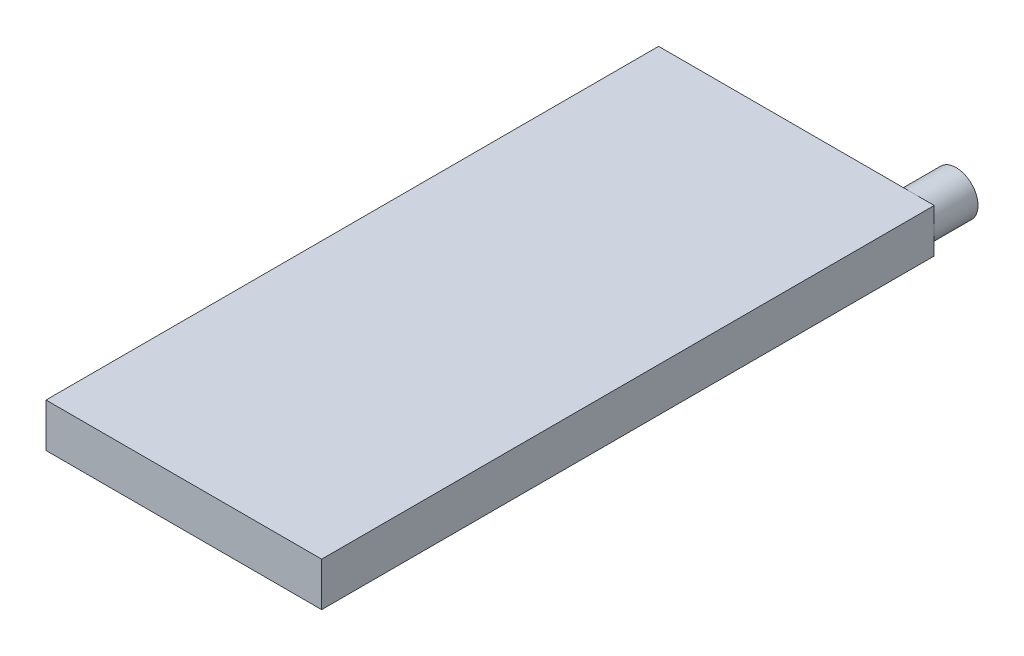
ISO-10303-21;
HEADER;
FILE_DESCRIPTION(('STEP AP214'),'2;1');
FILE_NAME('part.step','',(''),(''),'','','');
FILE_SCHEMA(('AUTOMOTIVE_DESIGN { 1 0 10303 214 1 1 1 1 }'));
ENDSEC;
DATA;
#1=APPLICATION_CONTEXT('core data for automotive mechanical design processes');
#2=APPLICATION_PROTOCOL_DEFINITION('international standard','automotive_design',2000,#1);
#3=PRODUCT_CONTEXT('',#1,'mechanical');
#4=PRODUCT('Part','Part','',(#3));
#5=PRODUCT_RELATED_PRODUCT_CATEGORY('part','',(#4));
#6=PRODUCT_DEFINITION_FORMATION('','',#4);
#7=PRODUCT_DEFINITION_CONTEXT('part definition',#1,'design');
#8=PRODUCT_DEFINITION('design','',#6,#7);
#9=PRODUCT_DEFINITION_SHAPE('','',#8);
#10=(LENGTH_UNIT() NAMED_UNIT(*) SI_UNIT(.MILLI.,.METRE.));
#11=(NAMED_UNIT(*) PLANE_ANGLE_UNIT() SI_UNIT($,.RADIAN.));
#12=(NAMED_UNIT(*) SI_UNIT($,.STERADIAN.) SOLID_ANGLE_UNIT());
#13=UNCERTAINTY_MEASURE_WITH_UNIT(LENGTH_MEASURE(1.E-05),#10,'distance_accuracy_value','');
#14=(GEOMETRIC_REPRESENTATION_CONTEXT(3) GLOBAL_UNCERTAINTY_ASSIGNED_CONTEXT((#13)) GLOBAL_UNIT_ASSIGNED_CONTEXT((#10,
#11,#12)) REPRESENTATION_CONTEXT('',''));
#15=CARTESIAN_POINT('',(0.,0.,0.));
#16=DIRECTION('',(0.,0.,1.));
#17=DIRECTION('',(1.,0.,0.));
#18=AXIS2_PLACEMENT_3D('',#15,#16,#17);
#19=CARTESIAN_POINT('',(0.,10.,-140.));
#20=DIRECTION('',(0.,0.,1.));
#21=DIRECTION('',(1.,0.,0.));
#22=AXIS2_PLACEMENT_3D('',#19,#20,#21);
#23=PLANE('',#22);
#24=CARTESIAN_POINT('',(-5.,5.,-140.));
#25=DIRECTION('',(0.,0.,-1.));
#26=DIRECTION('',(-1.,0.,0.));
#27=AXIS2_PLACEMENT_3D('',#24,#25,#26);
#28=CIRCLE('',#27,5.);
#29=CARTESIAN_POINT('',(-5.,10.,-140.));
#30=VERTEX_POINT('',#29);
#31=CARTESIAN_POINT('',(0.,5.,-140.));
#32=VERTEX_POINT('',#31);
#33=EDGE_CURVE('E44',#30,#32,#28,.T.);
#34=ORIENTED_EDGE('',*,*,#33,.F.);
#35=DIRECTION('',(-1.,0.,0.));
#36=VECTOR('',#35,1.);
#37=CARTESIAN_POINT('',(0.,10.,-140.));
#38=LINE('',#37,#36);
#39=CARTESIAN_POINT('',(0.,10.,-140.));
#40=VERTEX_POINT('',#39);
#41=EDGE_CURVE('E84',#40,#30,#38,.T.);
#42=ORIENTED_EDGE('',*,*,#41,.F.);
#43=DIRECTION('',(0.,-1.,0.));
#44=VECTOR('',#43,1.);
#45=CARTESIAN_POINT('',(0.,10.,-140.));
#46=LINE('',#45,#44);
#47=EDGE_CURVE('E37',#40,#32,#46,.T.);
#48=ORIENTED_EDGE('',*,*,#47,.T.);
#49=EDGE_LOOP('',(#34,#42,#48));
#50=FACE_BOUND('',#49,.T.);
#51=ADVANCED_FACE('F33',(#50),#23,.F.);
#52=CARTESIAN_POINT('',(-5.,0.,-140.));
#53=VERTEX_POINT('',#52);
#54=EDGE_CURVE('E11',#32,#53,#28,.T.);
#55=ORIENTED_EDGE('',*,*,#54,.F.);
#56=CARTESIAN_POINT('',(0.,0.,-140.));
#57=VERTEX_POINT('',#56);
#58=EDGE_CURVE('E104',#32,#57,#46,.T.);
#59=ORIENTED_EDGE('',*,*,#58,.T.);
#60=DIRECTION('',(-1.,0.,0.));
#61=VECTOR('',#60,1.);
#62=CARTESIAN_POINT('',(0.,0.,-140.));
#63=LINE('',#62,#61);
#64=EDGE_CURVE('E117',#57,#53,#63,.T.);
#65=ORIENTED_EDGE('',*,*,#64,.T.);
#66=EDGE_LOOP('',(#55,#59,#65));
#67=FACE_BOUND('',#66,.T.);
#68=ADVANCED_FACE('F129',(#67),#23,.F.);
#69=CARTESIAN_POINT('',(0.,10.,0.));
#70=DIRECTION('',(-1.,0.,0.));
#71=DIRECTION('',(0.,0.,1.));
#72=AXIS2_PLACEMENT_3D('',#69,#70,#71);
#73=PLANE('',#72);
#74=DIRECTION('',(0.,0.,-1.));
#75=VECTOR('',#74,1.);
#76=CARTESIAN_POINT('',(0.,0.,0.));
#77=LINE('',#76,#75);
#78=CARTESIAN_POINT('',(0.,0.,0.));
#79=VERTEX_POINT('',#78);
#80=EDGE_CURVE('E113',#79,#57,#77,.T.);
#81=ORIENTED_EDGE('',*,*,#80,.T.);
#82=ORIENTED_EDGE('',*,*,#58,.F.);
#83=ORIENTED_EDGE('',*,*,#47,.F.);
#84=DIRECTION('',(0.,0.,-1.));
#85=VECTOR('',#84,1.);
#86=CARTESIAN_POINT('',(0.,10.,0.));
#87=LINE('',#86,#85);
#88=CARTESIAN_POINT('',(0.,10.,0.));
#89=VERTEX_POINT('',#88);
#90=EDGE_CURVE('E89',#89,#40,#87,.T.);
#91=ORIENTED_EDGE('',*,*,#90,.F.);
#92=DIRECTION('',(0.,-1.,0.));
#93=VECTOR('',#92,1.);
#94=CARTESIAN_POINT('',(0.,10.,0.));
#95=LINE('',#94,#93);
#96=EDGE_CURVE('E112',#89,#79,#95,.T.);
#97=ORIENTED_EDGE('',*,*,#96,.T.);
#98=EDGE_LOOP('',(#81,#82,#83,#91,#97));
#99=FACE_BOUND('',#98,.T.);
#100=ADVANCED_FACE('F35',(#99),#73,.F.);
#101=EDGE_CURVE('E42',#53,#30,#28,.T.);
#102=ORIENTED_EDGE('',*,*,#101,.F.);
#103=CARTESIAN_POINT('',(-63.,0.,-140.));
#104=VERTEX_POINT('',#103);
#105=EDGE_CURVE('E116',#53,#104,#63,.T.);
#106=ORIENTED_EDGE('',*,*,#105,.T.);
#107=DIRECTION('',(0.,-1.,0.));
#108=VECTOR('',#107,1.);
#109=CARTESIAN_POINT('',(-63.,10.,-140.));
#110=LINE('',#109,#108);
#111=CARTESIAN_POINT('',(-63.,10.,-140.));
#112=VERTEX_POINT('',#111);
#113=EDGE_CURVE('E98',#112,#104,#110,.T.);
#114=ORIENTED_EDGE('',*,*,#113,.F.);
#115=EDGE_CURVE('E86',#30,#112,#38,.T.);
#116=ORIENTED_EDGE('',*,*,#115,.F.);
#117=EDGE_LOOP('',(#102,#106,#114,#116));
#118=FACE_BOUND('',#117,.T.);
#119=ADVANCED_FACE('F96',(#118),#23,.F.);
#120=CARTESIAN_POINT('',(-63.,10.,0.));
#121=DIRECTION('',(1.,0.,0.));
#122=DIRECTION('',(0.,0.,-1.));
#123=AXIS2_PLACEMENT_3D('',#120,#121,#122);
#124=PLANE('',#123);
#125=DIRECTION('',(0.,0.,1.));
#126=VECTOR('',#125,1.);
#127=CARTESIAN_POINT('',(-63.,0.,0.));
#128=LINE('',#127,#126);
#129=CARTESIAN_POINT('',(-63.,0.,0.));
#130=VERTEX_POINT('',#129);
#131=EDGE_CURVE('E119',#104,#130,#128,.T.);
#132=ORIENTED_EDGE('',*,*,#131,.T.);
#133=DIRECTION('',(0.,-1.,0.));
#134=VECTOR('',#133,1.);
#135=CARTESIAN_POINT('',(-63.,10.,0.));
#136=LINE('',#135,#134);
#137=CARTESIAN_POINT('',(-63.,10.,0.));
#138=VERTEX_POINT('',#137);
#139=EDGE_CURVE('E124',#138,#130,#136,.T.);
#140=ORIENTED_EDGE('',*,*,#139,.F.);
#141=DIRECTION('',(0.,0.,1.));
#142=VECTOR('',#141,1.);
#143=CARTESIAN_POINT('',(-63.,10.,0.));
#144=LINE('',#143,#142);
#145=EDGE_CURVE('E94',#112,#138,#144,.T.);
#146=ORIENTED_EDGE('',*,*,#145,.F.);
#147=ORIENTED_EDGE('',*,*,#113,.T.);
#148=EDGE_LOOP('',(#132,#140,#146,#147));
#149=FACE_BOUND('',#148,.T.);
#150=ADVANCED_FACE('F140',(#149),#124,.F.);
#151=CARTESIAN_POINT('',(0.,10.,0.));
#152=DIRECTION('',(0.,0.,-1.));
#153=DIRECTION('',(-1.,0.,0.));
#154=AXIS2_PLACEMENT_3D('',#151,#152,#153);
#155=PLANE('',#154);
#156=DIRECTION('',(1.,0.,0.));
#157=VECTOR('',#156,1.);
#158=CARTESIAN_POINT('',(0.,0.,0.));
#159=LINE('',#158,#157);
#160=EDGE_CURVE('E107',#130,#79,#159,.T.);
#161=ORIENTED_EDGE('',*,*,#160,.T.);
#162=ORIENTED_EDGE('',*,*,#96,.F.);
#163=DIRECTION('',(1.,0.,0.));
#164=VECTOR('',#163,1.);
#165=CARTESIAN_POINT('',(0.,10.,0.));
#166=LINE('',#165,#164);
#167=EDGE_CURVE('E110',#138,#89,#166,.T.);
#168=ORIENTED_EDGE('',*,*,#167,.F.);
#169=ORIENTED_EDGE('',*,*,#139,.T.);
#170=EDGE_LOOP('',(#161,#162,#168,#169));
#171=FACE_BOUND('',#170,.T.);
#172=ADVANCED_FACE('F138',(#171),#155,.F.);
#173=CARTESIAN_POINT('',(0.,10.,0.));
#174=DIRECTION('',(0.,1.,0.));
#175=DIRECTION('',(0.,0.,1.));
#176=AXIS2_PLACEMENT_3D('',#173,#174,#175);
#177=PLANE('',#176);
#178=ORIENTED_EDGE('',*,*,#90,.T.);
#179=ORIENTED_EDGE('',*,*,#41,.T.);
#180=ORIENTED_EDGE('',*,*,#115,.T.);
#181=ORIENTED_EDGE('',*,*,#145,.T.);
#182=ORIENTED_EDGE('',*,*,#167,.T.);
#183=EDGE_LOOP('',(#178,#179,#180,#181,#182));
#184=FACE_BOUND('',#183,.T.);
#185=ADVANCED_FACE('F85',(#184),#177,.T.);
#186=CARTESIAN_POINT('',(0.,0.,0.));
#187=DIRECTION('',(0.,1.,0.));
#188=DIRECTION('',(0.,0.,1.));
#189=AXIS2_PLACEMENT_3D('',#186,#187,#188);
#190=PLANE('',#189);
#191=ORIENTED_EDGE('',*,*,#80,.F.);
#192=ORIENTED_EDGE('',*,*,#160,.F.);
#193=ORIENTED_EDGE('',*,*,#131,.F.);
#194=ORIENTED_EDGE('',*,*,#105,.F.);
#195=ORIENTED_EDGE('',*,*,#64,.F.);
#196=EDGE_LOOP('',(#191,#192,#193,#194,#195));
#197=FACE_BOUND('',#196,.T.);
#198=ADVANCED_FACE('F133',(#197),#190,.F.);
#199=CARTESIAN_POINT('',(-5.,5.,-150.));
#200=DIRECTION('',(0.,0.,1.));
#201=DIRECTION('',(1.,0.,0.));
#202=AXIS2_PLACEMENT_3D('',#199,#200,#201);
#203=CYLINDRICAL_SURFACE('',#202,5.);
#204=CARTESIAN_POINT('',(-5.,5.,-150.));
#205=DIRECTION('',(0.,0.,-1.));
#206=DIRECTION('',(-1.,0.,0.));
#207=AXIS2_PLACEMENT_3D('',#204,#205,#206);
#208=CIRCLE('',#207,5.);
#209=CARTESIAN_POINT('',(-10.,5.,-150.));
#210=VERTEX_POINT('',#209);
#211=EDGE_CURVE('E102',#210,#210,#208,.T.);
#212=ORIENTED_EDGE('',*,*,#211,.F.);
#213=EDGE_LOOP('',(#212));
#214=FACE_BOUND('',#213,.T.);
#215=ORIENTED_EDGE('',*,*,#33,.T.);
#216=ORIENTED_EDGE('',*,*,#54,.T.);
#217=ORIENTED_EDGE('',*,*,#101,.T.);
#218=EDGE_LOOP('',(#215,#216,#217));
#219=FACE_BOUND('',#218,.T.);
#220=ADVANCED_FACE('F103',(#214,#219),#203,.T.);
#221=CARTESIAN_POINT('',(-5.,5.,-150.));
#222=DIRECTION('',(0.,0.,-1.));
#223=DIRECTION('',(-1.,0.,0.));
#224=AXIS2_PLACEMENT_3D('',#221,#222,#223);
#225=PLANE('',#224);
#226=ORIENTED_EDGE('',*,*,#211,.T.);
#227=EDGE_LOOP('',(#226));
#228=FACE_BOUND('',#227,.T.);
#229=ADVANCED_FACE('F189',(#228),#225,.T.);
#230=CLOSED_SHELL('',(#51,#68,#100,#119,#150,#172,#185,#198,#220,#229));
#231=MANIFOLD_SOLID_BREP('B2',#230);
#232=ADVANCED_BREP_SHAPE_REPRESENTATION('',(#18,#231),#14);
#233=SHAPE_DEFINITION_REPRESENTATION(#9,#232);
ENDSEC;
END-ISO-10303-21;
